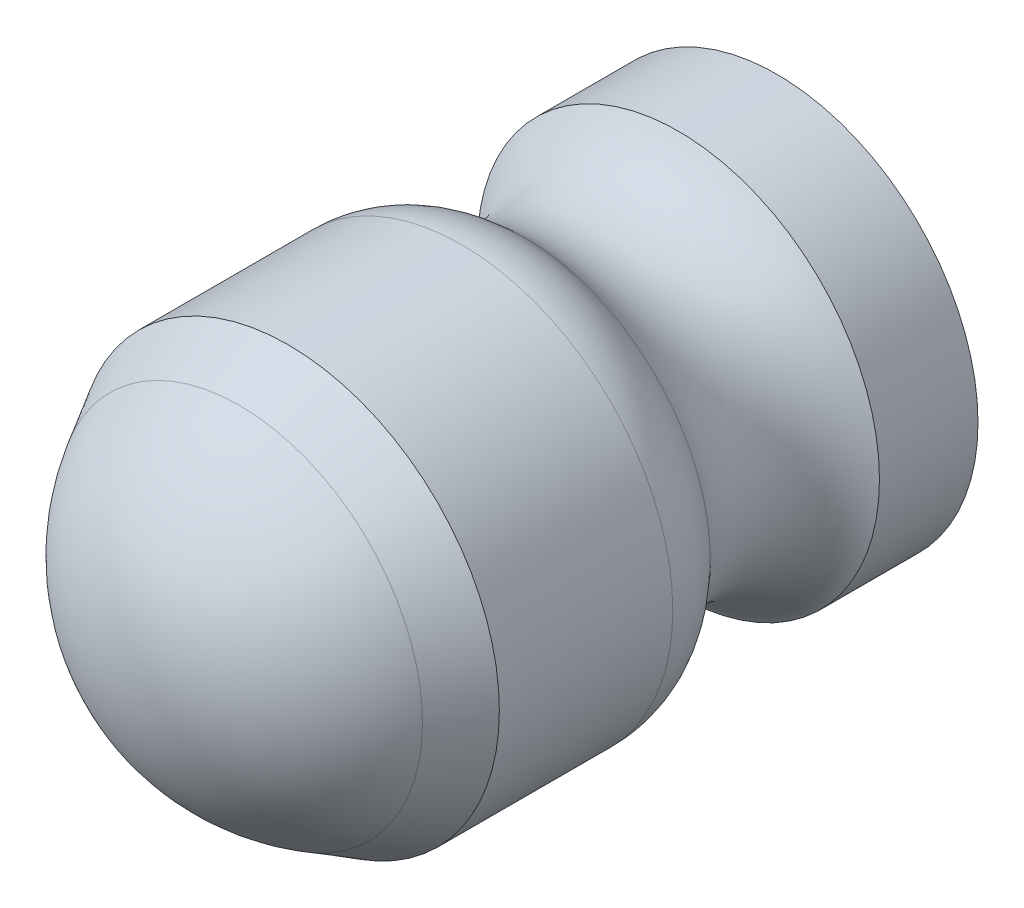
ISO-10303-21;
HEADER;
FILE_DESCRIPTION(('STEP AP214'),'2;1');
FILE_NAME('part.step','',(''),(''),'','','');
FILE_SCHEMA(('AUTOMOTIVE_DESIGN { 1 0 10303 214 1 1 1 1 }'));
ENDSEC;
DATA;
#1=APPLICATION_CONTEXT('core data for automotive mechanical design processes');
#2=APPLICATION_PROTOCOL_DEFINITION('international standard','automotive_design',2000,#1);
#3=PRODUCT_CONTEXT('',#1,'mechanical');
#4=PRODUCT('Part','Part','',(#3));
#5=PRODUCT_RELATED_PRODUCT_CATEGORY('part','',(#4));
#6=PRODUCT_DEFINITION_FORMATION('','',#4);
#7=PRODUCT_DEFINITION_CONTEXT('part definition',#1,'design');
#8=PRODUCT_DEFINITION('design','',#6,#7);
#9=PRODUCT_DEFINITION_SHAPE('','',#8);
#10=(LENGTH_UNIT() NAMED_UNIT(*) SI_UNIT(.MILLI.,.METRE.));
#11=(NAMED_UNIT(*) PLANE_ANGLE_UNIT() SI_UNIT($,.RADIAN.));
#12=(NAMED_UNIT(*) SI_UNIT($,.STERADIAN.) SOLID_ANGLE_UNIT());
#13=UNCERTAINTY_MEASURE_WITH_UNIT(LENGTH_MEASURE(1.E-05),#10,'distance_accuracy_value','');
#14=(GEOMETRIC_REPRESENTATION_CONTEXT(3) GLOBAL_UNCERTAINTY_ASSIGNED_CONTEXT((#13)) GLOBAL_UNIT_ASSIGNED_CONTEXT((#10,
#11,#12)) REPRESENTATION_CONTEXT('',''));
#15=CARTESIAN_POINT('',(0.,0.,0.));
#16=DIRECTION('',(0.,0.,1.));
#17=DIRECTION('',(1.,0.,0.));
#18=AXIS2_PLACEMENT_3D('',#15,#16,#17);
#19=CARTESIAN_POINT('',(0.,0.,8.));
#20=DIRECTION('',(0.,0.,-1.));
#21=DIRECTION('',(-1.,0.,0.));
#22=AXIS2_PLACEMENT_3D('',#19,#20,#21);
#23=CYLINDRICAL_SURFACE('',#22,10.5);
#24=CARTESIAN_POINT('',(0.,0.,8.));
#25=DIRECTION('',(0.,0.,1.));
#26=DIRECTION('',(1.,0.,0.));
#27=AXIS2_PLACEMENT_3D('',#24,#25,#26);
#28=CIRCLE('',#27,10.5);
#29=CARTESIAN_POINT('',(10.5,0.,8.));
#30=VERTEX_POINT('',#29);
#31=EDGE_CURVE('E10',#30,#30,#28,.T.);
#32=ORIENTED_EDGE('',*,*,#31,.F.);
#33=EDGE_LOOP('',(#32));
#34=FACE_BOUND('',#33,.T.);
#35=CARTESIAN_POINT('',(0.,0.,-0.623533648309606));
#36=DIRECTION('',(0.,0.,1.));
#37=DIRECTION('',(1.,0.,0.));
#38=AXIS2_PLACEMENT_3D('',#35,#36,#37);
#39=CIRCLE('',#38,10.5);
#40=CARTESIAN_POINT('',(10.5,0.,-0.623533648309606));
#41=VERTEX_POINT('',#40);
#42=EDGE_CURVE('E54',#41,#41,#39,.T.);
#43=ORIENTED_EDGE('',*,*,#42,.T.);
#44=EDGE_LOOP('',(#43));
#45=FACE_BOUND('',#44,.T.);
#46=ADVANCED_FACE('F32',(#34,#45),#23,.T.);
#47=CARTESIAN_POINT('',(0.,0.,5.2));
#48=DIRECTION('',(0.,0.,-1.));
#49=DIRECTION('',(0.,1.,0.));
#50=AXIS2_PLACEMENT_3D('',#47,#48,#49);
#51=SPHERICAL_SURFACE('',#50,10.5);
#52=CARTESIAN_POINT('',(0.,0.,10.4282157676349));
#53=DIRECTION('',(0.,0.,-1.));
#54=DIRECTION('',(0.,1.,0.));
#55=AXIS2_PLACEMENT_3D('',#52,#53,#54);
#56=CIRCLE('',#55,9.1058091286307);
#57=CARTESIAN_POINT('',(0.,9.1058091286307,10.4282157676349));
#58=VERTEX_POINT('',#57);
#59=EDGE_CURVE('E38',#58,#58,#56,.T.);
#60=ORIENTED_EDGE('',*,*,#59,.F.);
#61=EDGE_LOOP('',(#60));
#62=FACE_BOUND('',#61,.T.);
#63=ADVANCED_FACE('F92',(#62),#51,.T.);
#64=CARTESIAN_POINT('',(0.,0.,8.));
#65=DIRECTION('',(0.,0.,-1.));
#66=DIRECTION('',(0.,1.,0.));
#67=AXIS2_PLACEMENT_3D('',#64,#65,#66);
#68=CONICAL_SURFACE('',#67,10.5,0.521204783494683);
#69=ORIENTED_EDGE('',*,*,#59,.T.);
#70=EDGE_LOOP('',(#69));
#71=FACE_BOUND('',#70,.T.);
#72=ORIENTED_EDGE('',*,*,#31,.T.);
#73=EDGE_LOOP('',(#72));
#74=FACE_BOUND('',#73,.T.);
#75=ADVANCED_FACE('F77',(#71,#74),#68,.T.);
#76=CARTESIAN_POINT('',(0.,10.,-16.3));
#77=DIRECTION('',(0.,0.,1.));
#78=DIRECTION('',(1.,0.,0.));
#79=AXIS2_PLACEMENT_3D('',#76,#77,#78);
#80=PLANE('',#79);
#81=CARTESIAN_POINT('',(0.,0.,-16.3));
#82=DIRECTION('',(0.,0.,-1.));
#83=DIRECTION('',(-1.,0.,0.));
#84=AXIS2_PLACEMENT_3D('',#81,#82,#83);
#85=CIRCLE('',#84,3.);
#86=CARTESIAN_POINT('',(-3.,0.,-16.3));
#87=VERTEX_POINT('',#86);
#88=EDGE_CURVE('E58',#87,#87,#85,.T.);
#89=ORIENTED_EDGE('',*,*,#88,.F.);
#90=EDGE_LOOP('',(#89));
#91=FACE_BOUND('',#90,.T.);
#92=CARTESIAN_POINT('',(0.,0.,-16.3));
#93=DIRECTION('',(0.,0.,1.));
#94=DIRECTION('',(1.,0.,0.));
#95=AXIS2_PLACEMENT_3D('',#92,#93,#94);
#96=CIRCLE('',#95,10.);
#97=CARTESIAN_POINT('',(10.,0.,-16.3));
#98=VERTEX_POINT('',#97);
#99=EDGE_CURVE('E42',#98,#98,#96,.T.);
#100=ORIENTED_EDGE('',*,*,#99,.F.);
#101=EDGE_LOOP('',(#100));
#102=FACE_BOUND('',#101,.T.);
#103=ADVANCED_FACE('F73',(#91,#102),#80,.F.);
#104=CARTESIAN_POINT('',(0.,0.,0.));
#105=DIRECTION('',(0.,0.,1.));
#106=DIRECTION('',(1.,0.,0.));
#107=AXIS2_PLACEMENT_3D('',#104,#105,#106);
#108=CYLINDRICAL_SURFACE('',#107,10.);
#109=CARTESIAN_POINT('',(0.,0.,-11.4));
#110=DIRECTION('',(0.,0.,1.));
#111=DIRECTION('',(1.,0.,0.));
#112=AXIS2_PLACEMENT_3D('',#109,#110,#111);
#113=CIRCLE('',#112,10.);
#114=CARTESIAN_POINT('',(10.,0.,-11.4));
#115=VERTEX_POINT('',#114);
#116=EDGE_CURVE('E46',#115,#115,#113,.T.);
#117=ORIENTED_EDGE('',*,*,#116,.F.);
#118=EDGE_LOOP('',(#117));
#119=FACE_BOUND('',#118,.T.);
#120=ORIENTED_EDGE('',*,*,#99,.T.);
#121=EDGE_LOOP('',(#120));
#122=FACE_BOUND('',#121,.T.);
#123=ADVANCED_FACE('F76',(#119,#122),#108,.T.);
#124=CARTESIAN_POINT('',(0.,0.,-7.25753696455841));
#125=DIRECTION('',(0.,0.,1.));
#126=DIRECTION('',(1.,0.,0.));
#127=AXIS2_PLACEMENT_3D('',#124,#125,#126);
#128=TOROIDAL_SURFACE('',#127,12.8,5.);
#129=CARTESIAN_POINT('',(0.,0.,-3.76595627179588));
#130=DIRECTION('',(0.,0.,1.));
#131=DIRECTION('',(1.,0.,0.));
#132=AXIS2_PLACEMENT_3D('',#129,#130,#131);
#133=CIRCLE('',#132,9.22105263157895);
#134=CARTESIAN_POINT('',(9.22105263157895,0.,-3.76595627179588));
#135=VERTEX_POINT('',#134);
#136=EDGE_CURVE('E51',#135,#135,#133,.T.);
#137=ORIENTED_EDGE('',*,*,#136,.F.);
#138=EDGE_LOOP('',(#137));
#139=FACE_BOUND('',#138,.T.);
#140=ORIENTED_EDGE('',*,*,#116,.T.);
#141=EDGE_LOOP('',(#140));
#142=FACE_BOUND('',#141,.T.);
#143=ADVANCED_FACE('F82',(#139,#142),#128,.F.);
#144=CARTESIAN_POINT('',(0.,0.,-0.623533648309606));
#145=DIRECTION('',(0.,0.,1.));
#146=DIRECTION('',(1.,0.,0.));
#147=AXIS2_PLACEMENT_3D('',#144,#145,#146);
#148=TOROIDAL_SURFACE('',#147,6.,4.5);
#149=ORIENTED_EDGE('',*,*,#42,.F.);
#150=EDGE_LOOP('',(#149));
#151=FACE_BOUND('',#150,.T.);
#152=ORIENTED_EDGE('',*,*,#136,.T.);
#153=EDGE_LOOP('',(#152));
#154=FACE_BOUND('',#153,.T.);
#155=ADVANCED_FACE('F69',(#151,#154),#148,.T.);
#156=CARTESIAN_POINT('',(0.,0.,-1.3));
#157=DIRECTION('',(0.,0.,-1.));
#158=DIRECTION('',(-1.,0.,0.));
#159=AXIS2_PLACEMENT_3D('',#156,#157,#158);
#160=CYLINDRICAL_SURFACE('',#159,3.);
#161=CARTESIAN_POINT('',(0.,0.,-1.3));
#162=DIRECTION('',(0.,0.,-1.));
#163=DIRECTION('',(-1.,0.,0.));
#164=AXIS2_PLACEMENT_3D('',#161,#162,#163);
#165=CIRCLE('',#164,3.);
#166=CARTESIAN_POINT('',(-3.,0.,-1.3));
#167=VERTEX_POINT('',#166);
#168=EDGE_CURVE('E57',#167,#167,#165,.T.);
#169=ORIENTED_EDGE('',*,*,#168,.F.);
#170=EDGE_LOOP('',(#169));
#171=FACE_BOUND('',#170,.T.);
#172=ORIENTED_EDGE('',*,*,#88,.T.);
#173=EDGE_LOOP('',(#172));
#174=FACE_BOUND('',#173,.T.);
#175=ADVANCED_FACE('F66',(#171,#174),#160,.F.);
#176=CARTESIAN_POINT('',(0.,0.,-1.3));
#177=DIRECTION('',(0.,0.,-1.));
#178=DIRECTION('',(-1.,0.,0.));
#179=AXIS2_PLACEMENT_3D('',#176,#177,#178);
#180=PLANE('',#179);
#181=ORIENTED_EDGE('',*,*,#168,.T.);
#182=EDGE_LOOP('',(#181));
#183=FACE_BOUND('',#182,.T.);
#184=ADVANCED_FACE('F64',(#183),#180,.T.);
#185=CLOSED_SHELL('',(#46,#63,#75,#103,#123,#143,#155,#175,#184));
#186=MANIFOLD_SOLID_BREP('B2',#185);
#187=ADVANCED_BREP_SHAPE_REPRESENTATION('',(#18,#186),#14);
#188=SHAPE_DEFINITION_REPRESENTATION(#9,#187);
ENDSEC;
END-ISO-10303-21;
